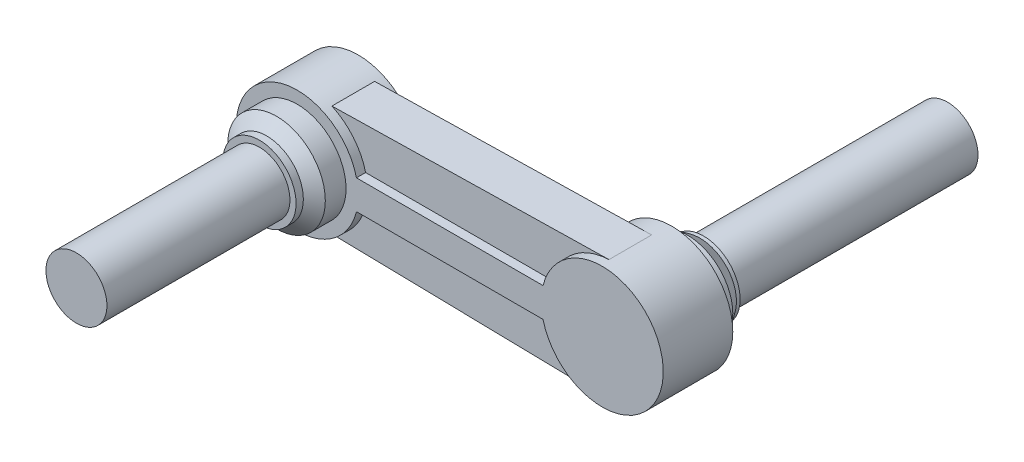
ISO-10303-21;
HEADER;
FILE_DESCRIPTION(('STEP AP214'),'2;1');
FILE_NAME('part.step','',(''),(''),'','','');
FILE_SCHEMA(('AUTOMOTIVE_DESIGN { 1 0 10303 214 1 1 1 1 }'));
ENDSEC;
DATA;
#1=APPLICATION_CONTEXT('core data for automotive mechanical design processes');
#2=APPLICATION_PROTOCOL_DEFINITION('international standard','automotive_design',2000,#1);
#3=PRODUCT_CONTEXT('',#1,'mechanical');
#4=PRODUCT('Part','Part','',(#3));
#5=PRODUCT_RELATED_PRODUCT_CATEGORY('part','',(#4));
#6=PRODUCT_DEFINITION_FORMATION('','',#4);
#7=PRODUCT_DEFINITION_CONTEXT('part definition',#1,'design');
#8=PRODUCT_DEFINITION('design','',#6,#7);
#9=PRODUCT_DEFINITION_SHAPE('','',#8);
#10=(LENGTH_UNIT() NAMED_UNIT(*) SI_UNIT(.MILLI.,.METRE.));
#11=(NAMED_UNIT(*) PLANE_ANGLE_UNIT() SI_UNIT($,.RADIAN.));
#12=(NAMED_UNIT(*) SI_UNIT($,.STERADIAN.) SOLID_ANGLE_UNIT());
#13=UNCERTAINTY_MEASURE_WITH_UNIT(LENGTH_MEASURE(1.E-05),#10,'distance_accuracy_value','');
#14=(GEOMETRIC_REPRESENTATION_CONTEXT(3) GLOBAL_UNCERTAINTY_ASSIGNED_CONTEXT((#13)) GLOBAL_UNIT_ASSIGNED_CONTEXT((#10,
#11,#12)) REPRESENTATION_CONTEXT('',''));
#15=CARTESIAN_POINT('',(0.,0.,0.));
#16=DIRECTION('',(0.,0.,1.));
#17=DIRECTION('',(1.,0.,0.));
#18=AXIS2_PLACEMENT_3D('',#15,#16,#17);
#19=CARTESIAN_POINT('',(-250.,0.,114.));
#20=DIRECTION('',(0.,0.,1.));
#21=DIRECTION('',(1.,0.,0.));
#22=AXIS2_PLACEMENT_3D('',#19,#20,#21);
#23=PLANE('',#22);
#24=CARTESIAN_POINT('',(-250.,0.,114.));
#25=DIRECTION('',(0.,0.,1.));
#26=DIRECTION('',(1.,0.,0.));
#27=AXIS2_PLACEMENT_3D('',#24,#25,#26);
#28=CIRCLE('',#27,30.);
#29=CARTESIAN_POINT('',(-220.,0.,114.));
#30=VERTEX_POINT('',#29);
#31=EDGE_CURVE('E247',#30,#30,#28,.T.);
#32=ORIENTED_EDGE('',*,*,#31,.T.);
#33=EDGE_LOOP('',(#32));
#34=FACE_BOUND('',#33,.T.);
#35=CARTESIAN_POINT('',(-250.,0.,114.));
#36=DIRECTION('',(0.,0.,1.));
#37=DIRECTION('',(1.,0.,0.));
#38=AXIS2_PLACEMENT_3D('',#35,#36,#37);
#39=CIRCLE('',#38,25.);
#40=CARTESIAN_POINT('',(-225.,0.,114.));
#41=VERTEX_POINT('',#40);
#42=EDGE_CURVE('E254',#41,#41,#39,.T.);
#43=ORIENTED_EDGE('',*,*,#42,.F.);
#44=EDGE_LOOP('',(#43));
#45=FACE_BOUND('',#44,.T.);
#46=ADVANCED_FACE('F31',(#34,#45),#23,.T.);
#47=CARTESIAN_POINT('',(0.,0.,83.));
#48=DIRECTION('',(0.,0.,1.));
#49=DIRECTION('',(1.,0.,0.));
#50=AXIS2_PLACEMENT_3D('',#47,#48,#49);
#51=PLANE('',#50);
#52=CARTESIAN_POINT('',(0.,0.,83.));
#53=DIRECTION('',(0.,0.,1.));
#54=DIRECTION('',(1.,0.,0.));
#55=AXIS2_PLACEMENT_3D('',#52,#53,#54);
#56=CIRCLE('',#55,50.);
#57=CARTESIAN_POINT('',(-48.5386443980464,-12.,83.));
#58=VERTEX_POINT('',#57);
#59=CARTESIAN_POINT('',(-48.5386443980464,12.,83.));
#60=VERTEX_POINT('',#59);
#61=EDGE_CURVE('E173',#58,#60,#56,.T.);
#62=ORIENTED_EDGE('',*,*,#61,.T.);
#63=DIRECTION('',(-1.,0.,0.));
#64=VECTOR('',#63,1.);
#65=CARTESIAN_POINT('',(-201.461355601954,12.,83.));
#66=LINE('',#65,#64);
#67=CARTESIAN_POINT('',(-201.461355601954,12.,83.));
#68=VERTEX_POINT('',#67);
#69=EDGE_CURVE('E129',#60,#68,#66,.T.);
#70=ORIENTED_EDGE('',*,*,#69,.T.);
#71=CARTESIAN_POINT('',(-250.,0.,83.));
#72=DIRECTION('',(0.,0.,1.));
#73=DIRECTION('',(1.,0.,0.));
#74=AXIS2_PLACEMENT_3D('',#71,#72,#73);
#75=CIRCLE('',#74,50.);
#76=CARTESIAN_POINT('',(-201.461355601954,-12.,83.));
#77=VERTEX_POINT('',#76);
#78=EDGE_CURVE('E130',#68,#77,#75,.T.);
#79=ORIENTED_EDGE('',*,*,#78,.T.);
#80=DIRECTION('',(1.,0.,0.));
#81=VECTOR('',#80,1.);
#82=CARTESIAN_POINT('',(-201.461355601954,-12.,83.));
#83=LINE('',#82,#81);
#84=EDGE_CURVE('E120',#77,#58,#83,.T.);
#85=ORIENTED_EDGE('',*,*,#84,.T.);
#86=EDGE_LOOP('',(#62,#70,#79,#85));
#87=FACE_BOUND('',#86,.T.);
#88=CARTESIAN_POINT('',(-250.,0.,83.));
#89=DIRECTION('',(0.,0.,1.));
#90=DIRECTION('',(1.,0.,0.));
#91=AXIS2_PLACEMENT_3D('',#88,#89,#90);
#92=CIRCLE('',#91,40.);
#93=CARTESIAN_POINT('',(-210.,0.,83.));
#94=VERTEX_POINT('',#93);
#95=EDGE_CURVE('E240',#94,#94,#92,.T.);
#96=ORIENTED_EDGE('',*,*,#95,.F.);
#97=EDGE_LOOP('',(#96));
#98=FACE_BOUND('',#97,.T.);
#99=ADVANCED_FACE('F133',(#87,#98),#51,.T.);
#100=CARTESIAN_POINT('',(0.,0.,83.));
#101=DIRECTION('',(0.,0.,-1.));
#102=DIRECTION('',(-1.,0.,0.));
#103=AXIS2_PLACEMENT_3D('',#100,#101,#102);
#104=CYLINDRICAL_SURFACE('',#103,50.);
#105=CARTESIAN_POINT('',(0.,0.,26.));
#106=DIRECTION('',(0.,0.,1.));
#107=DIRECTION('',(1.,0.,0.));
#108=AXIS2_PLACEMENT_3D('',#105,#106,#107);
#109=CIRCLE('',#108,50.);
#110=CARTESIAN_POINT('',(50.,0.,26.));
#111=VERTEX_POINT('',#110);
#112=EDGE_CURVE('E198',#111,#111,#109,.T.);
#113=ORIENTED_EDGE('',*,*,#112,.T.);
#114=EDGE_LOOP('',(#113));
#115=FACE_BOUND('',#114,.T.);
#116=DIRECTION('',(0.,0.,-1.));
#117=VECTOR('',#116,1.);
#118=CARTESIAN_POINT('',(-48.5386443980464,-12.,83.));
#119=LINE('',#118,#117);
#120=CARTESIAN_POINT('',(-48.5386443980464,-12.,75.5));
#121=VERTEX_POINT('',#120);
#122=EDGE_CURVE('E126',#121,#58,#119,.F.);
#123=ORIENTED_EDGE('',*,*,#122,.F.);
#124=CARTESIAN_POINT('',(0.,0.,75.5));
#125=DIRECTION('',(0.,0.,1.));
#126=DIRECTION('',(1.,0.,0.));
#127=AXIS2_PLACEMENT_3D('',#124,#125,#126);
#128=CIRCLE('',#127,50.);
#129=CARTESIAN_POINT('',(-1.99920031987218,-49.9600159936026,75.5));
#130=VERTEX_POINT('',#129);
#131=EDGE_CURVE('E209',#121,#130,#128,.T.);
#132=ORIENTED_EDGE('',*,*,#131,.T.);
#133=DIRECTION('',(0.,0.,-1.));
#134=VECTOR('',#133,1.);
#135=CARTESIAN_POINT('',(-1.99920031987218,-49.9600159936026,83.));
#136=LINE('',#135,#134);
#137=CARTESIAN_POINT('',(-1.9992003198724,-49.9600159936025,40.5));
#138=VERTEX_POINT('',#137);
#139=EDGE_CURVE('E212',#130,#138,#136,.T.);
#140=ORIENTED_EDGE('',*,*,#139,.T.);
#141=CARTESIAN_POINT('',(0.,0.,40.5));
#142=DIRECTION('',(0.,0.,1.));
#143=DIRECTION('',(1.,0.,0.));
#144=AXIS2_PLACEMENT_3D('',#141,#142,#143);
#145=CIRCLE('',#144,50.);
#146=CARTESIAN_POINT('',(-48.5386443980464,-12.,40.5));
#147=VERTEX_POINT('',#146);
#148=EDGE_CURVE('E201',#147,#138,#145,.T.);
#149=ORIENTED_EDGE('',*,*,#148,.F.);
#150=CARTESIAN_POINT('',(-48.5386443980464,-12.,33.));
#151=VERTEX_POINT('',#150);
#152=EDGE_CURVE('E46',#151,#147,#119,.F.);
#153=ORIENTED_EDGE('',*,*,#152,.F.);
#154=CARTESIAN_POINT('',(0.,0.,33.));
#155=DIRECTION('',(0.,0.,1.));
#156=DIRECTION('',(1.,0.,0.));
#157=AXIS2_PLACEMENT_3D('',#154,#155,#156);
#158=CIRCLE('',#157,50.);
#159=CARTESIAN_POINT('',(-48.5386443980464,12.,33.));
#160=VERTEX_POINT('',#159);
#161=EDGE_CURVE('E39',#160,#151,#158,.T.);
#162=ORIENTED_EDGE('',*,*,#161,.F.);
#163=DIRECTION('',(0.,0.,-1.));
#164=VECTOR('',#163,1.);
#165=CARTESIAN_POINT('',(-48.5386443980464,12.,83.));
#166=LINE('',#165,#164);
#167=CARTESIAN_POINT('',(-48.5386443980464,12.,40.5));
#168=VERTEX_POINT('',#167);
#169=EDGE_CURVE('E145',#168,#160,#166,.T.);
#170=ORIENTED_EDGE('',*,*,#169,.F.);
#171=CARTESIAN_POINT('',(-1.99920031987414,49.9600159936025,40.5));
#172=VERTEX_POINT('',#171);
#173=EDGE_CURVE('E202',#172,#168,#145,.T.);
#174=ORIENTED_EDGE('',*,*,#173,.F.);
#175=DIRECTION('',(0.,0.,-1.));
#176=VECTOR('',#175,1.);
#177=CARTESIAN_POINT('',(-1.99920031987393,49.9600159936025,83.));
#178=LINE('',#177,#176);
#179=CARTESIAN_POINT('',(-1.99920031987393,49.9600159936025,75.5));
#180=VERTEX_POINT('',#179);
#181=EDGE_CURVE('E204',#180,#172,#178,.T.);
#182=ORIENTED_EDGE('',*,*,#181,.F.);
#183=CARTESIAN_POINT('',(-48.5386443980464,12.,75.5));
#184=VERTEX_POINT('',#183);
#185=EDGE_CURVE('E205',#180,#184,#128,.T.);
#186=ORIENTED_EDGE('',*,*,#185,.T.);
#187=EDGE_CURVE('E150',#60,#184,#166,.T.);
#188=ORIENTED_EDGE('',*,*,#187,.F.);
#189=ORIENTED_EDGE('',*,*,#61,.F.);
#190=EDGE_LOOP('',(#123,#132,#140,#149,#153,#162,#170,#174,#182,#186,#188,#189));
#191=FACE_BOUND('',#190,.T.);
#192=ADVANCED_FACE('F274',(#115,#191),#104,.T.);
#193=CARTESIAN_POINT('',(-117.862178278423,-47.6427564344316,75.5));
#194=DIRECTION('',(-0.0199960011996,-0.999800059980007,0.));
#195=DIRECTION('',(0.999800059980007,-0.0199960011996,0.));
#196=AXIS2_PLACEMENT_3D('',#193,#194,#195);
#197=PLANE('',#196);
#198=DIRECTION('',(-0.999800059980007,0.0199960011996,0.));
#199=VECTOR('',#198,1.);
#200=CARTESIAN_POINT('',(-117.862178278423,-47.6427564344316,75.5));
#201=LINE('',#200,#199);
#202=CARTESIAN_POINT('',(-229.090939394971,-45.4181812121006,75.5));
#203=VERTEX_POINT('',#202);
#204=EDGE_CURVE('E166',#130,#203,#201,.T.);
#205=ORIENTED_EDGE('',*,*,#204,.T.);
#206=DIRECTION('',(0.,0.,-1.));
#207=VECTOR('',#206,1.);
#208=CARTESIAN_POINT('',(-229.090939394971,-45.4181812121006,83.));
#209=LINE('',#208,#207);
#210=CARTESIAN_POINT('',(-229.090939394971,-45.4181812121006,40.5));
#211=VERTEX_POINT('',#210);
#212=EDGE_CURVE('E164',#203,#211,#209,.T.);
#213=ORIENTED_EDGE('',*,*,#212,.T.);
#214=DIRECTION('',(-0.999800059980007,0.0199960011996,0.));
#215=VECTOR('',#214,1.);
#216=CARTESIAN_POINT('',(-117.862178278423,-47.6427564344316,40.5));
#217=LINE('',#216,#215);
#218=EDGE_CURVE('E174',#138,#211,#217,.T.);
#219=ORIENTED_EDGE('',*,*,#218,.F.);
#220=ORIENTED_EDGE('',*,*,#139,.F.);
#221=EDGE_LOOP('',(#205,#213,#219,#220));
#222=FACE_BOUND('',#221,.T.);
#223=ADVANCED_FACE('F310',(#222),#197,.T.);
#224=CARTESIAN_POINT('',(-129.039061225775,47.4192187754844,75.5));
#225=DIRECTION('',(0.0199960011996003,-0.999800059980007,0.));
#226=DIRECTION('',(0.999800059980007,0.0199960011996003,0.));
#227=AXIS2_PLACEMENT_3D('',#224,#225,#226);
#228=PLANE('',#227);
#229=DIRECTION('',(0.,0.,-1.));
#230=VECTOR('',#229,1.);
#231=CARTESIAN_POINT('',(-229.090939394971,45.4181812121005,83.));
#232=LINE('',#231,#230);
#233=CARTESIAN_POINT('',(-229.090939394971,45.4181812121005,75.5));
#234=VERTEX_POINT('',#233);
#235=CARTESIAN_POINT('',(-229.090939394971,45.4181812121005,40.5));
#236=VERTEX_POINT('',#235);
#237=EDGE_CURVE('E159',#234,#236,#232,.T.);
#238=ORIENTED_EDGE('',*,*,#237,.F.);
#239=DIRECTION('',(-0.999800059980007,-0.0199960011996003,0.));
#240=VECTOR('',#239,1.);
#241=CARTESIAN_POINT('',(-129.039061225775,47.4192187754844,75.5));
#242=LINE('',#241,#240);
#243=EDGE_CURVE('E169',#180,#234,#242,.T.);
#244=ORIENTED_EDGE('',*,*,#243,.F.);
#245=ORIENTED_EDGE('',*,*,#181,.T.);
#246=DIRECTION('',(-0.999800059980007,-0.0199960011996003,0.));
#247=VECTOR('',#246,1.);
#248=CARTESIAN_POINT('',(-129.039061225775,47.4192187754844,40.5));
#249=LINE('',#248,#247);
#250=EDGE_CURVE('E170',#172,#236,#249,.T.);
#251=ORIENTED_EDGE('',*,*,#250,.T.);
#252=EDGE_LOOP('',(#238,#244,#245,#251));
#253=FACE_BOUND('',#252,.T.);
#254=ADVANCED_FACE('F303',(#253),#228,.F.);
#255=CARTESIAN_POINT('',(-122.5,-279.53384251329,75.5));
#256=DIRECTION('',(0.,0.,1.));
#257=DIRECTION('',(1.,0.,0.));
#258=AXIS2_PLACEMENT_3D('',#255,#256,#257);
#259=PLANE('',#258);
#260=DIRECTION('',(-1.,0.,0.));
#261=VECTOR('',#260,1.);
#262=CARTESIAN_POINT('',(-122.5,-12.,75.5));
#263=LINE('',#262,#261);
#264=CARTESIAN_POINT('',(-201.461355601954,-12.,75.5));
#265=VERTEX_POINT('',#264);
#266=EDGE_CURVE('E157',#121,#265,#263,.T.);
#267=ORIENTED_EDGE('',*,*,#266,.T.);
#268=CARTESIAN_POINT('',(-250.,0.,75.5));
#269=DIRECTION('',(0.,0.,1.));
#270=DIRECTION('',(1.,0.,0.));
#271=AXIS2_PLACEMENT_3D('',#268,#269,#270);
#272=CIRCLE('',#271,50.);
#273=EDGE_CURVE('E144',#265,#203,#272,.F.);
#274=ORIENTED_EDGE('',*,*,#273,.T.);
#275=ORIENTED_EDGE('',*,*,#204,.F.);
#276=ORIENTED_EDGE('',*,*,#131,.F.);
#277=EDGE_LOOP('',(#267,#274,#275,#276));
#278=FACE_BOUND('',#277,.T.);
#279=ADVANCED_FACE('F299',(#278),#259,.T.);
#280=ORIENTED_EDGE('',*,*,#243,.T.);
#281=CARTESIAN_POINT('',(-201.461355601954,12.,75.5));
#282=VERTEX_POINT('',#281);
#283=EDGE_CURVE('E162',#234,#282,#272,.F.);
#284=ORIENTED_EDGE('',*,*,#283,.T.);
#285=DIRECTION('',(1.,0.,0.));
#286=VECTOR('',#285,1.);
#287=CARTESIAN_POINT('',(-122.5,12.,75.5));
#288=LINE('',#287,#286);
#289=EDGE_CURVE('E148',#282,#184,#288,.T.);
#290=ORIENTED_EDGE('',*,*,#289,.T.);
#291=ORIENTED_EDGE('',*,*,#185,.F.);
#292=EDGE_LOOP('',(#280,#284,#290,#291));
#293=FACE_BOUND('',#292,.T.);
#294=ADVANCED_FACE('F302',(#293),#259,.T.);
#295=CARTESIAN_POINT('',(-122.5,-279.53384251329,40.5));
#296=DIRECTION('',(0.,0.,1.));
#297=DIRECTION('',(1.,0.,0.));
#298=AXIS2_PLACEMENT_3D('',#295,#296,#297);
#299=PLANE('',#298);
#300=CARTESIAN_POINT('',(-250.,0.,40.5));
#301=DIRECTION('',(0.,0.,1.));
#302=DIRECTION('',(1.,0.,0.));
#303=AXIS2_PLACEMENT_3D('',#300,#301,#302);
#304=CIRCLE('',#303,50.);
#305=CARTESIAN_POINT('',(-201.461355601954,-12.,40.5));
#306=VERTEX_POINT('',#305);
#307=EDGE_CURVE('E221',#306,#211,#304,.F.);
#308=ORIENTED_EDGE('',*,*,#307,.F.);
#309=DIRECTION('',(-1.,0.,0.));
#310=VECTOR('',#309,1.);
#311=CARTESIAN_POINT('',(-122.5,-12.,40.5));
#312=LINE('',#311,#310);
#313=EDGE_CURVE('E220',#147,#306,#312,.T.);
#314=ORIENTED_EDGE('',*,*,#313,.F.);
#315=ORIENTED_EDGE('',*,*,#148,.T.);
#316=ORIENTED_EDGE('',*,*,#218,.T.);
#317=EDGE_LOOP('',(#308,#314,#315,#316));
#318=FACE_BOUND('',#317,.T.);
#319=ADVANCED_FACE('F231',(#318),#299,.F.);
#320=CARTESIAN_POINT('',(-201.461355601954,12.,40.5));
#321=VERTEX_POINT('',#320);
#322=EDGE_CURVE('E217',#236,#321,#304,.F.);
#323=ORIENTED_EDGE('',*,*,#322,.F.);
#324=ORIENTED_EDGE('',*,*,#250,.F.);
#325=ORIENTED_EDGE('',*,*,#173,.T.);
#326=DIRECTION('',(1.,0.,0.));
#327=VECTOR('',#326,1.);
#328=CARTESIAN_POINT('',(-122.5,12.,40.5));
#329=LINE('',#328,#327);
#330=EDGE_CURVE('E208',#321,#168,#329,.T.);
#331=ORIENTED_EDGE('',*,*,#330,.F.);
#332=EDGE_LOOP('',(#323,#324,#325,#331));
#333=FACE_BOUND('',#332,.T.);
#334=ADVANCED_FACE('F307',(#333),#299,.F.);
#335=CARTESIAN_POINT('',(0.,0.,-200.));
#336=DIRECTION('',(0.,0.,1.));
#337=DIRECTION('',(1.,0.,0.));
#338=AXIS2_PLACEMENT_3D('',#335,#336,#337);
#339=CYLINDRICAL_SURFACE('',#338,25.);
#340=CARTESIAN_POINT('',(0.,0.,-200.));
#341=DIRECTION('',(0.,0.,1.));
#342=DIRECTION('',(1.,0.,0.));
#343=AXIS2_PLACEMENT_3D('',#340,#341,#342);
#344=CIRCLE('',#343,25.);
#345=CARTESIAN_POINT('',(25.,0.,-200.));
#346=VERTEX_POINT('',#345);
#347=EDGE_CURVE('E190',#346,#346,#344,.T.);
#348=ORIENTED_EDGE('',*,*,#347,.T.);
#349=EDGE_LOOP('',(#348));
#350=FACE_BOUND('',#349,.T.);
#351=CARTESIAN_POINT('',(0.,0.,0.));
#352=DIRECTION('',(0.,0.,1.));
#353=DIRECTION('',(1.,0.,0.));
#354=AXIS2_PLACEMENT_3D('',#351,#352,#353);
#355=CIRCLE('',#354,25.);
#356=CARTESIAN_POINT('',(25.,0.,0.));
#357=VERTEX_POINT('',#356);
#358=EDGE_CURVE('E187',#357,#357,#355,.T.);
#359=ORIENTED_EDGE('',*,*,#358,.F.);
#360=EDGE_LOOP('',(#359));
#361=FACE_BOUND('',#360,.T.);
#362=ADVANCED_FACE('F334',(#350,#361),#339,.T.);
#363=CARTESIAN_POINT('',(0.,0.,-200.));
#364=DIRECTION('',(0.,0.,1.));
#365=DIRECTION('',(1.,0.,0.));
#366=AXIS2_PLACEMENT_3D('',#363,#364,#365);
#367=PLANE('',#366);
#368=ORIENTED_EDGE('',*,*,#347,.F.);
#369=EDGE_LOOP('',(#368));
#370=FACE_BOUND('',#369,.T.);
#371=ADVANCED_FACE('F330',(#370),#367,.F.);
#372=CARTESIAN_POINT('',(0.,0.,3.));
#373=DIRECTION('',(0.,0.,-1.));
#374=DIRECTION('',(-1.,0.,0.));
#375=AXIS2_PLACEMENT_3D('',#372,#373,#374);
#376=CYLINDRICAL_SURFACE('',#375,30.);
#377=CARTESIAN_POINT('',(0.,0.,3.));
#378=DIRECTION('',(0.,0.,1.));
#379=DIRECTION('',(1.,0.,0.));
#380=AXIS2_PLACEMENT_3D('',#377,#378,#379);
#381=CIRCLE('',#380,30.);
#382=CARTESIAN_POINT('',(30.,0.,3.));
#383=VERTEX_POINT('',#382);
#384=EDGE_CURVE('E184',#383,#383,#381,.T.);
#385=ORIENTED_EDGE('',*,*,#384,.F.);
#386=EDGE_LOOP('',(#385));
#387=FACE_BOUND('',#386,.T.);
#388=CARTESIAN_POINT('',(0.,0.,0.));
#389=DIRECTION('',(0.,0.,1.));
#390=DIRECTION('',(1.,0.,0.));
#391=AXIS2_PLACEMENT_3D('',#388,#389,#390);
#392=CIRCLE('',#391,30.);
#393=CARTESIAN_POINT('',(30.,0.,0.));
#394=VERTEX_POINT('',#393);
#395=EDGE_CURVE('E183',#394,#394,#392,.T.);
#396=ORIENTED_EDGE('',*,*,#395,.T.);
#397=EDGE_LOOP('',(#396));
#398=FACE_BOUND('',#397,.T.);
#399=ADVANCED_FACE('F326',(#387,#398),#376,.T.);
#400=CARTESIAN_POINT('',(0.,0.,0.));
#401=DIRECTION('',(0.,0.,1.));
#402=DIRECTION('',(1.,0.,0.));
#403=AXIS2_PLACEMENT_3D('',#400,#401,#402);
#404=PLANE('',#403);
#405=ORIENTED_EDGE('',*,*,#358,.T.);
#406=EDGE_LOOP('',(#405));
#407=FACE_BOUND('',#406,.T.);
#408=ORIENTED_EDGE('',*,*,#395,.F.);
#409=EDGE_LOOP('',(#408));
#410=FACE_BOUND('',#409,.T.);
#411=ADVANCED_FACE('F322',(#407,#410),#404,.F.);
#412=CARTESIAN_POINT('',(0.,0.,18.));
#413=DIRECTION('',(0.,0.,-1.));
#414=DIRECTION('',(-1.,0.,0.));
#415=AXIS2_PLACEMENT_3D('',#412,#413,#414);
#416=CYLINDRICAL_SURFACE('',#415,37.);
#417=CARTESIAN_POINT('',(0.,0.,12.9999999999999));
#418=DIRECTION('',(0.,0.,1.));
#419=DIRECTION('',(1.,0.,0.));
#420=AXIS2_PLACEMENT_3D('',#417,#418,#419);
#421=CIRCLE('',#420,37.);
#422=CARTESIAN_POINT('',(37.,0.,12.9999999999999));
#423=VERTEX_POINT('',#422);
#424=EDGE_CURVE('E193',#423,#423,#421,.T.);
#425=ORIENTED_EDGE('',*,*,#424,.T.);
#426=EDGE_LOOP('',(#425));
#427=FACE_BOUND('',#426,.T.);
#428=CARTESIAN_POINT('',(0.,0.,18.));
#429=DIRECTION('',(0.,0.,1.));
#430=DIRECTION('',(1.,0.,0.));
#431=AXIS2_PLACEMENT_3D('',#428,#429,#430);
#432=CIRCLE('',#431,37.);
#433=CARTESIAN_POINT('',(37.,0.,18.));
#434=VERTEX_POINT('',#433);
#435=EDGE_CURVE('E180',#434,#434,#432,.T.);
#436=ORIENTED_EDGE('',*,*,#435,.F.);
#437=EDGE_LOOP('',(#436));
#438=FACE_BOUND('',#437,.T.);
#439=ADVANCED_FACE('F318',(#427,#438),#416,.T.);
#440=CARTESIAN_POINT('',(0.,0.,12.9999999999999));
#441=DIRECTION('',(0.,0.,1.));
#442=DIRECTION('',(1.,0.,0.));
#443=AXIS2_PLACEMENT_3D('',#440,#441,#442);
#444=CONICAL_SURFACE('',#443,37.,0.610725964389208);
#445=ORIENTED_EDGE('',*,*,#384,.T.);
#446=EDGE_LOOP('',(#445));
#447=FACE_BOUND('',#446,.T.);
#448=ORIENTED_EDGE('',*,*,#424,.F.);
#449=EDGE_LOOP('',(#448));
#450=FACE_BOUND('',#449,.T.);
#451=ADVANCED_FACE('F321',(#447,#450),#444,.T.);
#452=CARTESIAN_POINT('',(0.,0.,26.));
#453=DIRECTION('',(0.,0.,1.));
#454=DIRECTION('',(1.,0.,0.));
#455=AXIS2_PLACEMENT_3D('',#452,#453,#454);
#456=CONICAL_SURFACE('',#455,50.,1.01914134426635);
#457=ORIENTED_EDGE('',*,*,#435,.T.);
#458=EDGE_LOOP('',(#457));
#459=FACE_BOUND('',#458,.T.);
#460=ORIENTED_EDGE('',*,*,#112,.F.);
#461=EDGE_LOOP('',(#460));
#462=FACE_BOUND('',#461,.T.);
#463=ADVANCED_FACE('F289',(#459,#462),#456,.T.);
#464=CARTESIAN_POINT('',(-250.,0.,33.));
#465=DIRECTION('',(0.,0.,1.));
#466=DIRECTION('',(1.,0.,0.));
#467=AXIS2_PLACEMENT_3D('',#464,#465,#466);
#468=PLANE('',#467);
#469=DIRECTION('',(-1.,0.,0.));
#470=VECTOR('',#469,1.);
#471=CARTESIAN_POINT('',(-201.461355601954,12.,33.));
#472=LINE('',#471,#470);
#473=CARTESIAN_POINT('',(-201.461355601954,12.,33.));
#474=VERTEX_POINT('',#473);
#475=EDGE_CURVE('E139',#160,#474,#472,.T.);
#476=ORIENTED_EDGE('',*,*,#475,.F.);
#477=ORIENTED_EDGE('',*,*,#161,.T.);
#478=DIRECTION('',(1.,0.,0.));
#479=VECTOR('',#478,1.);
#480=CARTESIAN_POINT('',(-201.461355601954,-12.,33.));
#481=LINE('',#480,#479);
#482=CARTESIAN_POINT('',(-201.461355601954,-12.,33.));
#483=VERTEX_POINT('',#482);
#484=EDGE_CURVE('E235',#483,#151,#481,.T.);
#485=ORIENTED_EDGE('',*,*,#484,.F.);
#486=CARTESIAN_POINT('',(-250.,0.,33.));
#487=DIRECTION('',(0.,0.,1.));
#488=DIRECTION('',(1.,0.,0.));
#489=AXIS2_PLACEMENT_3D('',#486,#487,#488);
#490=CIRCLE('',#489,50.);
#491=EDGE_CURVE('E237',#474,#483,#490,.T.);
#492=ORIENTED_EDGE('',*,*,#491,.F.);
#493=EDGE_LOOP('',(#476,#477,#485,#492));
#494=FACE_BOUND('',#493,.T.);
#495=ADVANCED_FACE('F286',(#494),#468,.F.);
#496=CARTESIAN_POINT('',(-201.461355601954,-12.,83.));
#497=DIRECTION('',(0.,1.,0.));
#498=DIRECTION('',(0.,0.,1.));
#499=AXIS2_PLACEMENT_3D('',#496,#497,#498);
#500=PLANE('',#499);
#501=ORIENTED_EDGE('',*,*,#266,.F.);
#502=ORIENTED_EDGE('',*,*,#122,.T.);
#503=ORIENTED_EDGE('',*,*,#84,.F.);
#504=DIRECTION('',(0.,0.,-1.));
#505=VECTOR('',#504,1.);
#506=CARTESIAN_POINT('',(-201.461355601954,-12.,83.));
#507=LINE('',#506,#505);
#508=EDGE_CURVE('E125',#77,#265,#507,.T.);
#509=ORIENTED_EDGE('',*,*,#508,.T.);
#510=EDGE_LOOP('',(#501,#502,#503,#509));
#511=FACE_BOUND('',#510,.T.);
#512=ADVANCED_FACE('F123',(#511),#500,.F.);
#513=ORIENTED_EDGE('',*,*,#484,.T.);
#514=ORIENTED_EDGE('',*,*,#152,.T.);
#515=ORIENTED_EDGE('',*,*,#313,.T.);
#516=EDGE_CURVE('E146',#306,#483,#507,.T.);
#517=ORIENTED_EDGE('',*,*,#516,.T.);
#518=EDGE_LOOP('',(#513,#514,#515,#517));
#519=FACE_BOUND('',#518,.T.);
#520=ADVANCED_FACE('F234',(#519),#500,.F.);
#521=CARTESIAN_POINT('',(-201.461355601954,12.,83.));
#522=DIRECTION('',(0.,-1.,0.));
#523=DIRECTION('',(0.,0.,-1.));
#524=AXIS2_PLACEMENT_3D('',#521,#522,#523);
#525=PLANE('',#524);
#526=ORIENTED_EDGE('',*,*,#69,.F.);
#527=ORIENTED_EDGE('',*,*,#187,.T.);
#528=ORIENTED_EDGE('',*,*,#289,.F.);
#529=DIRECTION('',(0.,0.,-1.));
#530=VECTOR('',#529,1.);
#531=CARTESIAN_POINT('',(-201.461355601954,12.,83.));
#532=LINE('',#531,#530);
#533=EDGE_CURVE('E151',#68,#282,#532,.T.);
#534=ORIENTED_EDGE('',*,*,#533,.F.);
#535=EDGE_LOOP('',(#526,#527,#528,#534));
#536=FACE_BOUND('',#535,.T.);
#537=ADVANCED_FACE('F290',(#536),#525,.F.);
#538=ORIENTED_EDGE('',*,*,#330,.T.);
#539=ORIENTED_EDGE('',*,*,#169,.T.);
#540=ORIENTED_EDGE('',*,*,#475,.T.);
#541=EDGE_CURVE('E243',#321,#474,#532,.T.);
#542=ORIENTED_EDGE('',*,*,#541,.F.);
#543=EDGE_LOOP('',(#538,#539,#540,#542));
#544=FACE_BOUND('',#543,.T.);
#545=ADVANCED_FACE('F293',(#544),#525,.F.);
#546=CARTESIAN_POINT('',(-250.,0.,83.));
#547=DIRECTION('',(0.,0.,-1.));
#548=DIRECTION('',(-1.,0.,0.));
#549=AXIS2_PLACEMENT_3D('',#546,#547,#548);
#550=CYLINDRICAL_SURFACE('',#549,50.);
#551=ORIENTED_EDGE('',*,*,#273,.F.);
#552=ORIENTED_EDGE('',*,*,#508,.F.);
#553=ORIENTED_EDGE('',*,*,#78,.F.);
#554=ORIENTED_EDGE('',*,*,#533,.T.);
#555=ORIENTED_EDGE('',*,*,#283,.F.);
#556=ORIENTED_EDGE('',*,*,#237,.T.);
#557=ORIENTED_EDGE('',*,*,#322,.T.);
#558=ORIENTED_EDGE('',*,*,#541,.T.);
#559=ORIENTED_EDGE('',*,*,#491,.T.);
#560=ORIENTED_EDGE('',*,*,#516,.F.);
#561=ORIENTED_EDGE('',*,*,#307,.T.);
#562=ORIENTED_EDGE('',*,*,#212,.F.);
#563=EDGE_LOOP('',(#551,#552,#553,#554,#555,#556,#557,#558,#559,#560,#561,#562));
#564=FACE_BOUND('',#563,.T.);
#565=ADVANCED_FACE('F142',(#564),#550,.T.);
#566=CARTESIAN_POINT('',(-250.,0.,108.));
#567=DIRECTION('',(0.,0.,-1.));
#568=DIRECTION('',(-1.,0.,0.));
#569=AXIS2_PLACEMENT_3D('',#566,#567,#568);
#570=CYLINDRICAL_SURFACE('',#569,40.);
#571=CARTESIAN_POINT('',(-250.,0.,99.9999999999999));
#572=DIRECTION('',(0.,0.,1.));
#573=DIRECTION('',(1.,0.,0.));
#574=AXIS2_PLACEMENT_3D('',#571,#572,#573);
#575=CIRCLE('',#574,40.);
#576=CARTESIAN_POINT('',(-210.,0.,99.9999999999999));
#577=VERTEX_POINT('',#576);
#578=EDGE_CURVE('E11',#577,#577,#575,.F.);
#579=ORIENTED_EDGE('',*,*,#578,.T.);
#580=EDGE_LOOP('',(#579));
#581=FACE_BOUND('',#580,.T.);
#582=ORIENTED_EDGE('',*,*,#95,.T.);
#583=EDGE_LOOP('',(#582));
#584=FACE_BOUND('',#583,.T.);
#585=ADVANCED_FACE('F281',(#581,#584),#570,.T.);
#586=CARTESIAN_POINT('',(-250.,0.,114.));
#587=DIRECTION('',(0.,0.,-1.));
#588=DIRECTION('',(-1.,0.,0.));
#589=AXIS2_PLACEMENT_3D('',#586,#587,#588);
#590=CYLINDRICAL_SURFACE('',#589,30.);
#591=ORIENTED_EDGE('',*,*,#31,.F.);
#592=EDGE_LOOP('',(#591));
#593=FACE_BOUND('',#592,.T.);
#594=CARTESIAN_POINT('',(-250.,0.,108.));
#595=DIRECTION('',(0.,0.,1.));
#596=DIRECTION('',(1.,0.,0.));
#597=AXIS2_PLACEMENT_3D('',#594,#595,#596);
#598=CIRCLE('',#597,30.);
#599=CARTESIAN_POINT('',(-220.,0.,108.));
#600=VERTEX_POINT('',#599);
#601=EDGE_CURVE('E248',#600,#600,#598,.T.);
#602=ORIENTED_EDGE('',*,*,#601,.T.);
#603=EDGE_LOOP('',(#602));
#604=FACE_BOUND('',#603,.T.);
#605=ADVANCED_FACE('F278',(#593,#604),#590,.T.);
#606=CARTESIAN_POINT('',(-250.,0.,108.));
#607=DIRECTION('',(0.,0.,-1.));
#608=DIRECTION('',(-1.,0.,0.));
#609=AXIS2_PLACEMENT_3D('',#606,#607,#608);
#610=CONICAL_SURFACE('',#609,30.,0.89605538457134);
#611=ORIENTED_EDGE('',*,*,#578,.F.);
#612=EDGE_LOOP('',(#611));
#613=FACE_BOUND('',#612,.T.);
#614=ORIENTED_EDGE('',*,*,#601,.F.);
#615=EDGE_LOOP('',(#614));
#616=FACE_BOUND('',#615,.T.);
#617=ADVANCED_FACE('F33',(#613,#616),#610,.T.);
#618=CARTESIAN_POINT('',(-250.,0.,264.));
#619=DIRECTION('',(0.,0.,-1.));
#620=DIRECTION('',(-1.,0.,0.));
#621=AXIS2_PLACEMENT_3D('',#618,#619,#620);
#622=CYLINDRICAL_SURFACE('',#621,25.);
#623=CARTESIAN_POINT('',(-250.,0.,264.));
#624=DIRECTION('',(0.,0.,1.));
#625=DIRECTION('',(1.,0.,0.));
#626=AXIS2_PLACEMENT_3D('',#623,#624,#625);
#627=CIRCLE('',#626,25.);
#628=CARTESIAN_POINT('',(-225.,0.,264.));
#629=VERTEX_POINT('',#628);
#630=EDGE_CURVE('E251',#629,#629,#627,.T.);
#631=ORIENTED_EDGE('',*,*,#630,.F.);
#632=EDGE_LOOP('',(#631));
#633=FACE_BOUND('',#632,.T.);
#634=ORIENTED_EDGE('',*,*,#42,.T.);
#635=EDGE_LOOP('',(#634));
#636=FACE_BOUND('',#635,.T.);
#637=ADVANCED_FACE('F262',(#633,#636),#622,.T.);
#638=CARTESIAN_POINT('',(-250.,0.,264.));
#639=DIRECTION('',(0.,0.,1.));
#640=DIRECTION('',(1.,0.,0.));
#641=AXIS2_PLACEMENT_3D('',#638,#639,#640);
#642=PLANE('',#641);
#643=ORIENTED_EDGE('',*,*,#630,.T.);
#644=EDGE_LOOP('',(#643));
#645=FACE_BOUND('',#644,.T.);
#646=ADVANCED_FACE('F260',(#645),#642,.T.);
#647=CLOSED_SHELL('',(#46,#99,#192,#223,#254,#279,#294,#319,#334,#362,#371,#399,#411,#439,#451,
#463,#495,#512,#520,#537,#545,#565,#585,#605,#617,#637,#646));
#648=MANIFOLD_SOLID_BREP('B2',#647);
#649=ADVANCED_BREP_SHAPE_REPRESENTATION('',(#18,#648),#14);
#650=SHAPE_DEFINITION_REPRESENTATION(#9,#649);
ENDSEC;
END-ISO-10303-21;
